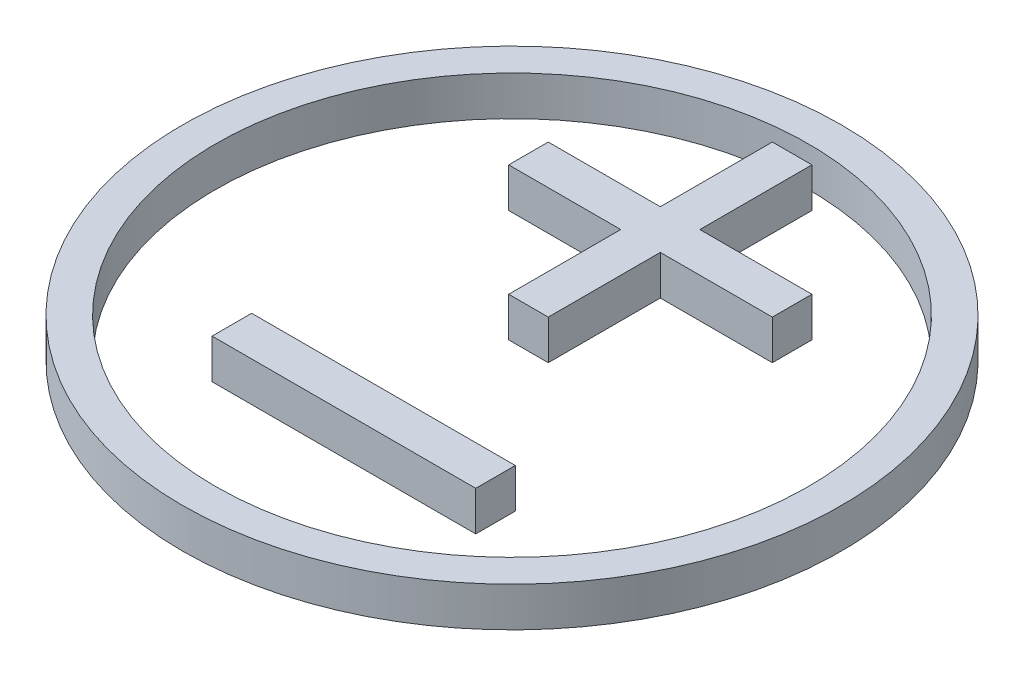
ISO-10303-21;
HEADER;
FILE_DESCRIPTION(('STEP AP214'),'2;1');
FILE_NAME('part.step','',(''),(''),'','','');
FILE_SCHEMA(('AUTOMOTIVE_DESIGN { 1 0 10303 214 1 1 1 1 }'));
ENDSEC;
DATA;
#1=APPLICATION_CONTEXT('core data for automotive mechanical design processes');
#2=APPLICATION_PROTOCOL_DEFINITION('international standard','automotive_design',2000,#1);
#3=PRODUCT_CONTEXT('',#1,'mechanical');
#4=PRODUCT('Part','Part','',(#3));
#5=PRODUCT_RELATED_PRODUCT_CATEGORY('part','',(#4));
#6=PRODUCT_DEFINITION_FORMATION('','',#4);
#7=PRODUCT_DEFINITION_CONTEXT('part definition',#1,'design');
#8=PRODUCT_DEFINITION('design','',#6,#7);
#9=PRODUCT_DEFINITION_SHAPE('','',#8);
#10=(LENGTH_UNIT() NAMED_UNIT(*) SI_UNIT(.MILLI.,.METRE.));
#11=(NAMED_UNIT(*) PLANE_ANGLE_UNIT() SI_UNIT($,.RADIAN.));
#12=(NAMED_UNIT(*) SI_UNIT($,.STERADIAN.) SOLID_ANGLE_UNIT());
#13=UNCERTAINTY_MEASURE_WITH_UNIT(LENGTH_MEASURE(1.E-05),#10,'distance_accuracy_value','');
#14=(GEOMETRIC_REPRESENTATION_CONTEXT(3) GLOBAL_UNCERTAINTY_ASSIGNED_CONTEXT((#13)) GLOBAL_UNIT_ASSIGNED_CONTEXT((#10,
#11,#12)) REPRESENTATION_CONTEXT('',''));
#15=CARTESIAN_POINT('',(0.,0.,0.));
#16=DIRECTION('',(0.,0.,1.));
#17=DIRECTION('',(1.,0.,0.));
#18=AXIS2_PLACEMENT_3D('',#15,#16,#17);
#19=CARTESIAN_POINT('',(0.,6.,0.));
#20=DIRECTION('',(0.,-1.,0.));
#21=DIRECTION('',(0.,0.,-1.));
#22=AXIS2_PLACEMENT_3D('',#19,#20,#21);
#23=CYLINDRICAL_SURFACE('',#22,45.);
#24=CARTESIAN_POINT('',(0.,6.,0.));
#25=DIRECTION('',(0.,1.,0.));
#26=DIRECTION('',(0.,0.,1.));
#27=AXIS2_PLACEMENT_3D('',#24,#25,#26);
#28=CIRCLE('',#27,45.);
#29=CARTESIAN_POINT('',(0.,6.,45.));
#30=VERTEX_POINT('',#29);
#31=EDGE_CURVE('E105',#30,#30,#28,.T.);
#32=ORIENTED_EDGE('',*,*,#31,.T.);
#33=EDGE_LOOP('',(#32));
#34=FACE_BOUND('',#33,.T.);
#35=CARTESIAN_POINT('',(0.,0.,0.));
#36=DIRECTION('',(0.,1.,0.));
#37=DIRECTION('',(0.,0.,1.));
#38=AXIS2_PLACEMENT_3D('',#35,#36,#37);
#39=CIRCLE('',#38,45.);
#40=CARTESIAN_POINT('',(0.,0.,45.));
#41=VERTEX_POINT('',#40);
#42=EDGE_CURVE('E111',#41,#41,#39,.T.);
#43=ORIENTED_EDGE('',*,*,#42,.F.);
#44=EDGE_LOOP('',(#43));
#45=FACE_BOUND('',#44,.T.);
#46=ADVANCED_FACE('F98',(#34,#45),#23,.F.);
#47=CARTESIAN_POINT('',(0.,6.,0.));
#48=DIRECTION('',(0.,-1.,0.));
#49=DIRECTION('',(0.,0.,-1.));
#50=AXIS2_PLACEMENT_3D('',#47,#48,#49);
#51=CYLINDRICAL_SURFACE('',#50,50.);
#52=CARTESIAN_POINT('',(0.,6.,0.));
#53=DIRECTION('',(0.,1.,0.));
#54=DIRECTION('',(0.,0.,1.));
#55=AXIS2_PLACEMENT_3D('',#52,#53,#54);
#56=CIRCLE('',#55,50.);
#57=CARTESIAN_POINT('',(0.,6.,50.));
#58=VERTEX_POINT('',#57);
#59=EDGE_CURVE('E12',#58,#58,#56,.T.);
#60=ORIENTED_EDGE('',*,*,#59,.F.);
#61=EDGE_LOOP('',(#60));
#62=FACE_BOUND('',#61,.T.);
#63=CARTESIAN_POINT('',(0.,0.,0.));
#64=DIRECTION('',(0.,1.,0.));
#65=DIRECTION('',(0.,0.,1.));
#66=AXIS2_PLACEMENT_3D('',#63,#64,#65);
#67=CIRCLE('',#66,50.);
#68=CARTESIAN_POINT('',(0.,0.,50.));
#69=VERTEX_POINT('',#68);
#70=EDGE_CURVE('E101',#69,#69,#67,.T.);
#71=ORIENTED_EDGE('',*,*,#70,.T.);
#72=EDGE_LOOP('',(#71));
#73=FACE_BOUND('',#72,.T.);
#74=ADVANCED_FACE('F118',(#62,#73),#51,.T.);
#75=CARTESIAN_POINT('',(0.,6.,0.));
#76=DIRECTION('',(0.,1.,0.));
#77=DIRECTION('',(0.,0.,1.));
#78=AXIS2_PLACEMENT_3D('',#75,#76,#77);
#79=PLANE('',#78);
#80=ORIENTED_EDGE('',*,*,#31,.F.);
#81=EDGE_LOOP('',(#80));
#82=FACE_BOUND('',#81,.T.);
#83=ORIENTED_EDGE('',*,*,#59,.T.);
#84=EDGE_LOOP('',(#83));
#85=FACE_BOUND('',#84,.T.);
#86=ADVANCED_FACE('F122',(#82,#85),#79,.T.);
#87=CARTESIAN_POINT('',(0.,0.,0.));
#88=DIRECTION('',(0.,1.,0.));
#89=DIRECTION('',(0.,0.,1.));
#90=AXIS2_PLACEMENT_3D('',#87,#88,#89);
#91=PLANE('',#90);
#92=ORIENTED_EDGE('',*,*,#42,.T.);
#93=EDGE_LOOP('',(#92));
#94=FACE_BOUND('',#93,.T.);
#95=ORIENTED_EDGE('',*,*,#70,.F.);
#96=EDGE_LOOP('',(#95));
#97=FACE_BOUND('',#96,.T.);
#98=ADVANCED_FACE('F120',(#94,#97),#91,.F.);
#99=CLOSED_SHELL('',(#46,#74,#86,#98));
#100=MANIFOLD_SOLID_BREP('B2',#99);
#101=CARTESIAN_POINT('',(0.,6.,19.5));
#102=DIRECTION('',(0.,0.,1.));
#103=DIRECTION('',(1.,0.,0.));
#104=AXIS2_PLACEMENT_3D('',#101,#102,#103);
#105=PLANE('',#104);
#106=DIRECTION('',(-1.,0.,0.));
#107=VECTOR('',#106,1.);
#108=CARTESIAN_POINT('',(0.,0.,19.5));
#109=LINE('',#108,#107);
#110=CARTESIAN_POINT('',(20.,0.,19.5));
#111=VERTEX_POINT('',#110);
#112=CARTESIAN_POINT('',(-20.,0.,19.5));
#113=VERTEX_POINT('',#112);
#114=EDGE_CURVE('E231',#111,#113,#109,.T.);
#115=ORIENTED_EDGE('',*,*,#114,.T.);
#116=DIRECTION('',(0.,-1.,0.));
#117=VECTOR('',#116,1.);
#118=CARTESIAN_POINT('',(-20.,6.,19.5));
#119=LINE('',#118,#117);
#120=CARTESIAN_POINT('',(-20.,6.,19.5));
#121=VERTEX_POINT('',#120);
#122=EDGE_CURVE('E96',#121,#113,#119,.T.);
#123=ORIENTED_EDGE('',*,*,#122,.F.);
#124=DIRECTION('',(-1.,0.,0.));
#125=VECTOR('',#124,1.);
#126=CARTESIAN_POINT('',(0.,6.,19.5));
#127=LINE('',#126,#125);
#128=CARTESIAN_POINT('',(20.,6.,19.5));
#129=VERTEX_POINT('',#128);
#130=EDGE_CURVE('E216',#129,#121,#127,.T.);
#131=ORIENTED_EDGE('',*,*,#130,.F.);
#132=DIRECTION('',(0.,-1.,0.));
#133=VECTOR('',#132,1.);
#134=CARTESIAN_POINT('',(20.,6.,19.5));
#135=LINE('',#134,#133);
#136=EDGE_CURVE('E227',#129,#111,#135,.T.);
#137=ORIENTED_EDGE('',*,*,#136,.T.);
#138=EDGE_LOOP('',(#115,#123,#131,#137));
#139=FACE_BOUND('',#138,.T.);
#140=ADVANCED_FACE('F169',(#139),#105,.F.);
#141=CARTESIAN_POINT('',(-20.,6.,0.));
#142=DIRECTION('',(1.,0.,0.));
#143=DIRECTION('',(0.,0.,-1.));
#144=AXIS2_PLACEMENT_3D('',#141,#142,#143);
#145=PLANE('',#144);
#146=DIRECTION('',(0.,0.,1.));
#147=VECTOR('',#146,1.);
#148=CARTESIAN_POINT('',(-20.,0.,0.));
#149=LINE('',#148,#147);
#150=CARTESIAN_POINT('',(-20.,0.,25.5));
#151=VERTEX_POINT('',#150);
#152=EDGE_CURVE('E221',#113,#151,#149,.T.);
#153=ORIENTED_EDGE('',*,*,#152,.T.);
#154=DIRECTION('',(0.,-1.,0.));
#155=VECTOR('',#154,1.);
#156=CARTESIAN_POINT('',(-20.,6.,25.5));
#157=LINE('',#156,#155);
#158=CARTESIAN_POINT('',(-20.,6.,25.5));
#159=VERTEX_POINT('',#158);
#160=EDGE_CURVE('E177',#159,#151,#157,.T.);
#161=ORIENTED_EDGE('',*,*,#160,.F.);
#162=DIRECTION('',(0.,0.,1.));
#163=VECTOR('',#162,1.);
#164=CARTESIAN_POINT('',(-20.,6.,0.));
#165=LINE('',#164,#163);
#166=EDGE_CURVE('E211',#121,#159,#165,.T.);
#167=ORIENTED_EDGE('',*,*,#166,.F.);
#168=ORIENTED_EDGE('',*,*,#122,.T.);
#169=EDGE_LOOP('',(#153,#161,#167,#168));
#170=FACE_BOUND('',#169,.T.);
#171=ADVANCED_FACE('F220',(#170),#145,.F.);
#172=CARTESIAN_POINT('',(0.,6.,25.5));
#173=DIRECTION('',(0.,0.,1.));
#174=DIRECTION('',(1.,0.,0.));
#175=AXIS2_PLACEMENT_3D('',#172,#173,#174);
#176=PLANE('',#175);
#177=DIRECTION('',(-1.,0.,0.));
#178=VECTOR('',#177,1.);
#179=CARTESIAN_POINT('',(0.,0.,25.5));
#180=LINE('',#179,#178);
#181=CARTESIAN_POINT('',(20.,0.,25.5));
#182=VERTEX_POINT('',#181);
#183=EDGE_CURVE('E235',#182,#151,#180,.T.);
#184=ORIENTED_EDGE('',*,*,#183,.F.);
#185=DIRECTION('',(0.,-1.,0.));
#186=VECTOR('',#185,1.);
#187=CARTESIAN_POINT('',(20.,6.,25.5));
#188=LINE('',#187,#186);
#189=CARTESIAN_POINT('',(20.,6.,25.5));
#190=VERTEX_POINT('',#189);
#191=EDGE_CURVE('E201',#190,#182,#188,.T.);
#192=ORIENTED_EDGE('',*,*,#191,.F.);
#193=DIRECTION('',(-1.,0.,0.));
#194=VECTOR('',#193,1.);
#195=CARTESIAN_POINT('',(0.,6.,25.5));
#196=LINE('',#195,#194);
#197=EDGE_CURVE('E214',#190,#159,#196,.T.);
#198=ORIENTED_EDGE('',*,*,#197,.T.);
#199=ORIENTED_EDGE('',*,*,#160,.T.);
#200=EDGE_LOOP('',(#184,#192,#198,#199));
#201=FACE_BOUND('',#200,.T.);
#202=ADVANCED_FACE('F225',(#201),#176,.T.);
#203=CARTESIAN_POINT('',(20.,6.,0.));
#204=DIRECTION('',(-1.,0.,0.));
#205=DIRECTION('',(0.,0.,1.));
#206=AXIS2_PLACEMENT_3D('',#203,#204,#205);
#207=PLANE('',#206);
#208=DIRECTION('',(0.,0.,-1.));
#209=VECTOR('',#208,1.);
#210=CARTESIAN_POINT('',(20.,0.,0.));
#211=LINE('',#210,#209);
#212=EDGE_CURVE('E204',#182,#111,#211,.T.);
#213=ORIENTED_EDGE('',*,*,#212,.T.);
#214=ORIENTED_EDGE('',*,*,#136,.F.);
#215=DIRECTION('',(0.,0.,-1.));
#216=VECTOR('',#215,1.);
#217=CARTESIAN_POINT('',(20.,6.,0.));
#218=LINE('',#217,#216);
#219=EDGE_CURVE('E185',#190,#129,#218,.T.);
#220=ORIENTED_EDGE('',*,*,#219,.F.);
#221=ORIENTED_EDGE('',*,*,#191,.T.);
#222=EDGE_LOOP('',(#213,#214,#220,#221));
#223=FACE_BOUND('',#222,.T.);
#224=ADVANCED_FACE('F248',(#223),#207,.F.);
#225=CARTESIAN_POINT('',(0.,6.,0.));
#226=DIRECTION('',(0.,1.,0.));
#227=DIRECTION('',(0.,0.,1.));
#228=AXIS2_PLACEMENT_3D('',#225,#226,#227);
#229=PLANE('',#228);
#230=ORIENTED_EDGE('',*,*,#130,.T.);
#231=ORIENTED_EDGE('',*,*,#166,.T.);
#232=ORIENTED_EDGE('',*,*,#197,.F.);
#233=ORIENTED_EDGE('',*,*,#219,.T.);
#234=EDGE_LOOP('',(#230,#231,#232,#233));
#235=FACE_BOUND('',#234,.T.);
#236=ADVANCED_FACE('F212',(#235),#229,.T.);
#237=CARTESIAN_POINT('',(0.,0.,0.));
#238=DIRECTION('',(0.,1.,0.));
#239=DIRECTION('',(0.,0.,1.));
#240=AXIS2_PLACEMENT_3D('',#237,#238,#239);
#241=PLANE('',#240);
#242=ORIENTED_EDGE('',*,*,#114,.F.);
#243=ORIENTED_EDGE('',*,*,#212,.F.);
#244=ORIENTED_EDGE('',*,*,#183,.T.);
#245=ORIENTED_EDGE('',*,*,#152,.F.);
#246=EDGE_LOOP('',(#242,#243,#244,#245));
#247=FACE_BOUND('',#246,.T.);
#248=ADVANCED_FACE('F242',(#247),#241,.F.);
#249=CLOSED_SHELL('',(#140,#171,#202,#224,#236,#248));
#250=MANIFOLD_SOLID_BREP('B7',#249);
#251=CARTESIAN_POINT('',(0.,6.,-19.5));
#252=DIRECTION('',(0.,0.,1.));
#253=DIRECTION('',(1.,0.,0.));
#254=AXIS2_PLACEMENT_3D('',#251,#252,#253);
#255=PLANE('',#254);
#256=DIRECTION('',(-1.,0.,0.));
#257=VECTOR('',#256,1.);
#258=CARTESIAN_POINT('',(0.,0.,-19.5));
#259=LINE('',#258,#257);
#260=CARTESIAN_POINT('',(-2.99999999999996,0.,-19.5));
#261=VERTEX_POINT('',#260);
#262=CARTESIAN_POINT('',(-20.,0.,-19.5));
#263=VERTEX_POINT('',#262);
#264=EDGE_CURVE('E424',#261,#263,#259,.T.);
#265=ORIENTED_EDGE('',*,*,#264,.F.);
#266=DIRECTION('',(0.,-1.,0.));
#267=VECTOR('',#266,1.);
#268=CARTESIAN_POINT('',(-2.99999999999996,6.,-19.5));
#269=LINE('',#268,#267);
#270=CARTESIAN_POINT('',(-2.99999999999996,6.,-19.5));
#271=VERTEX_POINT('',#270);
#272=EDGE_CURVE('E167',#271,#261,#269,.T.);
#273=ORIENTED_EDGE('',*,*,#272,.F.);
#274=DIRECTION('',(-1.,0.,0.));
#275=VECTOR('',#274,1.);
#276=CARTESIAN_POINT('',(0.,6.,-19.5));
#277=LINE('',#276,#275);
#278=CARTESIAN_POINT('',(-20.,6.,-19.5));
#279=VERTEX_POINT('',#278);
#280=EDGE_CURVE('E454',#271,#279,#277,.T.);
#281=ORIENTED_EDGE('',*,*,#280,.T.);
#282=DIRECTION('',(0.,-1.,0.));
#283=VECTOR('',#282,1.);
#284=CARTESIAN_POINT('',(-20.,6.,-19.5));
#285=LINE('',#284,#283);
#286=EDGE_CURVE('E321',#279,#263,#285,.T.);
#287=ORIENTED_EDGE('',*,*,#286,.T.);
#288=EDGE_LOOP('',(#265,#273,#281,#287));
#289=FACE_BOUND('',#288,.T.);
#290=ADVANCED_FACE('F305',(#289),#255,.T.);
#291=CARTESIAN_POINT('',(-2.99999999999945,6.,0.));
#292=DIRECTION('',(1.,0.,0.));
#293=DIRECTION('',(0.,0.,-1.));
#294=AXIS2_PLACEMENT_3D('',#291,#292,#293);
#295=PLANE('',#294);
#296=DIRECTION('',(0.,0.,1.));
#297=VECTOR('',#296,1.);
#298=CARTESIAN_POINT('',(-2.99999999999945,0.,0.));
#299=LINE('',#298,#297);
#300=CARTESIAN_POINT('',(-2.99999999999951,0.,-2.49999999999992));
#301=VERTEX_POINT('',#300);
#302=EDGE_CURVE('E426',#261,#301,#299,.T.);
#303=ORIENTED_EDGE('',*,*,#302,.T.);
#304=DIRECTION('',(0.,-1.,0.));
#305=VECTOR('',#304,1.);
#306=CARTESIAN_POINT('',(-2.99999999999951,6.,-2.49999999999992));
#307=LINE('',#306,#305);
#308=CARTESIAN_POINT('',(-2.99999999999951,6.,-2.49999999999992));
#309=VERTEX_POINT('',#308);
#310=EDGE_CURVE('E313',#309,#301,#307,.T.);
#311=ORIENTED_EDGE('',*,*,#310,.F.);
#312=DIRECTION('',(0.,0.,1.));
#313=VECTOR('',#312,1.);
#314=CARTESIAN_POINT('',(-2.99999999999945,6.,0.));
#315=LINE('',#314,#313);
#316=EDGE_CURVE('E494',#271,#309,#315,.T.);
#317=ORIENTED_EDGE('',*,*,#316,.F.);
#318=ORIENTED_EDGE('',*,*,#272,.T.);
#319=EDGE_LOOP('',(#303,#311,#317,#318));
#320=FACE_BOUND('',#319,.T.);
#321=ADVANCED_FACE('F523',(#320),#295,.F.);
#322=CARTESIAN_POINT('',(0.,6.,-2.5));
#323=DIRECTION('',(0.,0.,-1.));
#324=DIRECTION('',(-1.,0.,0.));
#325=AXIS2_PLACEMENT_3D('',#322,#323,#324);
#326=PLANE('',#325);
#327=DIRECTION('',(1.,0.,0.));
#328=VECTOR('',#327,1.);
#329=CARTESIAN_POINT('',(0.,0.,-2.5));
#330=LINE('',#329,#328);
#331=CARTESIAN_POINT('',(3.00000000000048,0.,-2.50000000000007));
#332=VERTEX_POINT('',#331);
#333=EDGE_CURVE('E428',#301,#332,#330,.T.);
#334=ORIENTED_EDGE('',*,*,#333,.T.);
#335=DIRECTION('',(0.,-1.,0.));
#336=VECTOR('',#335,1.);
#337=CARTESIAN_POINT('',(3.00000000000048,6.,-2.50000000000007));
#338=LINE('',#337,#336);
#339=CARTESIAN_POINT('',(3.00000000000048,6.,-2.50000000000007));
#340=VERTEX_POINT('',#339);
#341=EDGE_CURVE('E469',#340,#332,#338,.T.);
#342=ORIENTED_EDGE('',*,*,#341,.F.);
#343=DIRECTION('',(1.,0.,0.));
#344=VECTOR('',#343,1.);
#345=CARTESIAN_POINT('',(0.,6.,-2.5));
#346=LINE('',#345,#344);
#347=EDGE_CURVE('E477',#309,#340,#346,.T.);
#348=ORIENTED_EDGE('',*,*,#347,.F.);
#349=ORIENTED_EDGE('',*,*,#310,.T.);
#350=EDGE_LOOP('',(#334,#342,#348,#349));
#351=FACE_BOUND('',#350,.T.);
#352=ADVANCED_FACE('F475',(#351),#326,.F.);
#353=CARTESIAN_POINT('',(3.00000000000054,6.,0.));
#354=DIRECTION('',(1.,0.,0.));
#355=DIRECTION('',(0.,0.,-1.));
#356=AXIS2_PLACEMENT_3D('',#353,#354,#355);
#357=PLANE('',#356);
#358=DIRECTION('',(0.,0.,1.));
#359=VECTOR('',#358,1.);
#360=CARTESIAN_POINT('',(3.00000000000054,0.,0.));
#361=LINE('',#360,#359);
#362=CARTESIAN_POINT('',(3.00000000000024,0.,-19.5));
#363=VERTEX_POINT('',#362);
#364=EDGE_CURVE('E431',#363,#332,#361,.T.);
#365=ORIENTED_EDGE('',*,*,#364,.F.);
#366=DIRECTION('',(0.,-1.,0.));
#367=VECTOR('',#366,1.);
#368=CARTESIAN_POINT('',(3.00000000000024,6.,-19.5));
#369=LINE('',#368,#367);
#370=CARTESIAN_POINT('',(3.00000000000024,6.,-19.5));
#371=VERTEX_POINT('',#370);
#372=EDGE_CURVE('E467',#371,#363,#369,.T.);
#373=ORIENTED_EDGE('',*,*,#372,.F.);
#374=DIRECTION('',(0.,0.,1.));
#375=VECTOR('',#374,1.);
#376=CARTESIAN_POINT('',(3.00000000000054,6.,0.));
#377=LINE('',#376,#375);
#378=EDGE_CURVE('E489',#371,#340,#377,.T.);
#379=ORIENTED_EDGE('',*,*,#378,.T.);
#380=ORIENTED_EDGE('',*,*,#341,.T.);
#381=EDGE_LOOP('',(#365,#373,#379,#380));
#382=FACE_BOUND('',#381,.T.);
#383=ADVANCED_FACE('F485',(#382),#357,.T.);
#384=CARTESIAN_POINT('',(0.,6.,-19.5));
#385=DIRECTION('',(0.,0.,-1.));
#386=DIRECTION('',(-1.,0.,0.));
#387=AXIS2_PLACEMENT_3D('',#384,#385,#386);
#388=PLANE('',#387);
#389=DIRECTION('',(1.,0.,0.));
#390=VECTOR('',#389,1.);
#391=CARTESIAN_POINT('',(0.,0.,-19.5));
#392=LINE('',#391,#390);
#393=CARTESIAN_POINT('',(20.,0.,-19.5));
#394=VERTEX_POINT('',#393);
#395=EDGE_CURVE('E434',#363,#394,#392,.T.);
#396=ORIENTED_EDGE('',*,*,#395,.T.);
#397=DIRECTION('',(0.,-1.,0.));
#398=VECTOR('',#397,1.);
#399=CARTESIAN_POINT('',(20.,6.,-19.5));
#400=LINE('',#399,#398);
#401=CARTESIAN_POINT('',(20.,6.,-19.5));
#402=VERTEX_POINT('',#401);
#403=EDGE_CURVE('E465',#402,#394,#400,.T.);
#404=ORIENTED_EDGE('',*,*,#403,.F.);
#405=DIRECTION('',(1.,0.,0.));
#406=VECTOR('',#405,1.);
#407=CARTESIAN_POINT('',(0.,6.,-19.5));
#408=LINE('',#407,#406);
#409=EDGE_CURVE('E490',#371,#402,#408,.T.);
#410=ORIENTED_EDGE('',*,*,#409,.F.);
#411=ORIENTED_EDGE('',*,*,#372,.T.);
#412=EDGE_LOOP('',(#396,#404,#410,#411));
#413=FACE_BOUND('',#412,.T.);
#414=ADVANCED_FACE('F534',(#413),#388,.F.);
#415=CARTESIAN_POINT('',(20.,6.,0.));
#416=DIRECTION('',(1.,0.,0.));
#417=DIRECTION('',(0.,0.,-1.));
#418=AXIS2_PLACEMENT_3D('',#415,#416,#417);
#419=PLANE('',#418);
#420=DIRECTION('',(0.,0.,1.));
#421=VECTOR('',#420,1.);
#422=CARTESIAN_POINT('',(20.,0.,0.));
#423=LINE('',#422,#421);
#424=CARTESIAN_POINT('',(20.,0.,-25.5));
#425=VERTEX_POINT('',#424);
#426=EDGE_CURVE('E437',#425,#394,#423,.T.);
#427=ORIENTED_EDGE('',*,*,#426,.F.);
#428=DIRECTION('',(0.,-1.,0.));
#429=VECTOR('',#428,1.);
#430=CARTESIAN_POINT('',(20.,6.,-25.5));
#431=LINE('',#430,#429);
#432=CARTESIAN_POINT('',(20.,6.,-25.5));
#433=VERTEX_POINT('',#432);
#434=EDGE_CURVE('E463',#433,#425,#431,.T.);
#435=ORIENTED_EDGE('',*,*,#434,.F.);
#436=DIRECTION('',(0.,0.,1.));
#437=VECTOR('',#436,1.);
#438=CARTESIAN_POINT('',(20.,6.,0.));
#439=LINE('',#438,#437);
#440=EDGE_CURVE('E492',#433,#402,#439,.T.);
#441=ORIENTED_EDGE('',*,*,#440,.T.);
#442=ORIENTED_EDGE('',*,*,#403,.T.);
#443=EDGE_LOOP('',(#427,#435,#441,#442));
#444=FACE_BOUND('',#443,.T.);
#445=ADVANCED_FACE('F537',(#444),#419,.T.);
#446=CARTESIAN_POINT('',(0.,6.,-25.5));
#447=DIRECTION('',(0.,0.,-1.));
#448=DIRECTION('',(-1.,0.,0.));
#449=AXIS2_PLACEMENT_3D('',#446,#447,#448);
#450=PLANE('',#449);
#451=DIRECTION('',(1.,0.,0.));
#452=VECTOR('',#451,1.);
#453=CARTESIAN_POINT('',(0.,0.,-25.5));
#454=LINE('',#453,#452);
#455=CARTESIAN_POINT('',(2.99999999999996,0.,-25.5));
#456=VERTEX_POINT('',#455);
#457=EDGE_CURVE('E440',#456,#425,#454,.T.);
#458=ORIENTED_EDGE('',*,*,#457,.F.);
#459=DIRECTION('',(0.,-1.,0.));
#460=VECTOR('',#459,1.);
#461=CARTESIAN_POINT('',(2.99999999999996,6.,-25.5));
#462=LINE('',#461,#460);
#463=CARTESIAN_POINT('',(2.99999999999996,6.,-25.5));
#464=VERTEX_POINT('',#463);
#465=EDGE_CURVE('E461',#464,#456,#462,.T.);
#466=ORIENTED_EDGE('',*,*,#465,.F.);
#467=DIRECTION('',(1.,0.,0.));
#468=VECTOR('',#467,1.);
#469=CARTESIAN_POINT('',(0.,6.,-25.5));
#470=LINE('',#469,#468);
#471=EDGE_CURVE('E500',#464,#433,#470,.T.);
#472=ORIENTED_EDGE('',*,*,#471,.T.);
#473=ORIENTED_EDGE('',*,*,#434,.T.);
#474=EDGE_LOOP('',(#458,#466,#472,#473));
#475=FACE_BOUND('',#474,.T.);
#476=ADVANCED_FACE('F541',(#475),#450,.T.);
#477=CARTESIAN_POINT('',(3.00000000000054,6.,0.));
#478=DIRECTION('',(-1.,0.,0.));
#479=DIRECTION('',(0.,0.,1.));
#480=AXIS2_PLACEMENT_3D('',#477,#478,#479);
#481=PLANE('',#480);
#482=DIRECTION('',(0.,0.,-1.));
#483=VECTOR('',#482,1.);
#484=CARTESIAN_POINT('',(3.00000000000054,0.,0.));
#485=LINE('',#484,#483);
#486=CARTESIAN_POINT('',(2.99999999999951,0.,-42.5000000000001));
#487=VERTEX_POINT('',#486);
#488=EDGE_CURVE('E443',#456,#487,#485,.T.);
#489=ORIENTED_EDGE('',*,*,#488,.T.);
#490=DIRECTION('',(0.,-1.,0.));
#491=VECTOR('',#490,1.);
#492=CARTESIAN_POINT('',(2.99999999999951,6.,-42.5000000000001));
#493=LINE('',#492,#491);
#494=CARTESIAN_POINT('',(2.99999999999951,6.,-42.5000000000001));
#495=VERTEX_POINT('',#494);
#496=EDGE_CURVE('E458',#495,#487,#493,.T.);
#497=ORIENTED_EDGE('',*,*,#496,.F.);
#498=DIRECTION('',(0.,0.,-1.));
#499=VECTOR('',#498,1.);
#500=CARTESIAN_POINT('',(3.00000000000054,6.,0.));
#501=LINE('',#500,#499);
#502=EDGE_CURVE('E419',#464,#495,#501,.T.);
#503=ORIENTED_EDGE('',*,*,#502,.F.);
#504=ORIENTED_EDGE('',*,*,#465,.T.);
#505=EDGE_LOOP('',(#489,#497,#503,#504));
#506=FACE_BOUND('',#505,.T.);
#507=ADVANCED_FACE('F507',(#506),#481,.F.);
#508=CARTESIAN_POINT('',(-1.0321604682062E-12,6.,-42.5));
#509=DIRECTION('',(0.,0.,1.));
#510=DIRECTION('',(1.,0.,0.));
#511=AXIS2_PLACEMENT_3D('',#508,#509,#510);
#512=PLANE('',#511);
#513=DIRECTION('',(-1.,0.,0.));
#514=VECTOR('',#513,1.);
#515=CARTESIAN_POINT('',(-1.0321604682062E-12,0.,-42.5));
#516=LINE('',#515,#514);
#517=CARTESIAN_POINT('',(-3.00000000000048,0.,-42.4999999999999));
#518=VERTEX_POINT('',#517);
#519=EDGE_CURVE('E445',#487,#518,#516,.T.);
#520=ORIENTED_EDGE('',*,*,#519,.T.);
#521=DIRECTION('',(0.,-1.,0.));
#522=VECTOR('',#521,1.);
#523=CARTESIAN_POINT('',(-3.00000000000048,6.,-42.4999999999999));
#524=LINE('',#523,#522);
#525=CARTESIAN_POINT('',(-3.00000000000048,6.,-42.4999999999999));
#526=VERTEX_POINT('',#525);
#527=EDGE_CURVE('E405',#526,#518,#524,.T.);
#528=ORIENTED_EDGE('',*,*,#527,.F.);
#529=DIRECTION('',(-1.,0.,0.));
#530=VECTOR('',#529,1.);
#531=CARTESIAN_POINT('',(-1.0321604682062E-12,6.,-42.5));
#532=LINE('',#531,#530);
#533=EDGE_CURVE('E416',#495,#526,#532,.T.);
#534=ORIENTED_EDGE('',*,*,#533,.F.);
#535=ORIENTED_EDGE('',*,*,#496,.T.);
#536=EDGE_LOOP('',(#520,#528,#534,#535));
#537=FACE_BOUND('',#536,.T.);
#538=ADVANCED_FACE('F511',(#537),#512,.F.);
#539=CARTESIAN_POINT('',(-2.99999999999946,6.,0.));
#540=DIRECTION('',(-1.,0.,0.));
#541=DIRECTION('',(0.,0.,1.));
#542=AXIS2_PLACEMENT_3D('',#539,#540,#541);
#543=PLANE('',#542);
#544=DIRECTION('',(0.,0.,-1.));
#545=VECTOR('',#544,1.);
#546=CARTESIAN_POINT('',(-2.99999999999946,0.,0.));
#547=LINE('',#546,#545);
#548=CARTESIAN_POINT('',(-3.00000000000024,0.,-25.5));
#549=VERTEX_POINT('',#548);
#550=EDGE_CURVE('E402',#549,#518,#547,.T.);
#551=ORIENTED_EDGE('',*,*,#550,.F.);
#552=DIRECTION('',(0.,-1.,0.));
#553=VECTOR('',#552,1.);
#554=CARTESIAN_POINT('',(-3.00000000000024,6.,-25.5));
#555=LINE('',#554,#553);
#556=CARTESIAN_POINT('',(-3.00000000000024,6.,-25.5));
#557=VERTEX_POINT('',#556);
#558=EDGE_CURVE('E396',#557,#549,#555,.T.);
#559=ORIENTED_EDGE('',*,*,#558,.F.);
#560=DIRECTION('',(0.,0.,-1.));
#561=VECTOR('',#560,1.);
#562=CARTESIAN_POINT('',(-2.99999999999946,6.,0.));
#563=LINE('',#562,#561);
#564=EDGE_CURVE('E400',#557,#526,#563,.T.);
#565=ORIENTED_EDGE('',*,*,#564,.T.);
#566=ORIENTED_EDGE('',*,*,#527,.T.);
#567=EDGE_LOOP('',(#551,#559,#565,#566));
#568=FACE_BOUND('',#567,.T.);
#569=ADVANCED_FACE('F398',(#568),#543,.T.);
#570=CARTESIAN_POINT('',(0.,6.,-25.5));
#571=DIRECTION('',(0.,0.,1.));
#572=DIRECTION('',(1.,0.,0.));
#573=AXIS2_PLACEMENT_3D('',#570,#571,#572);
#574=PLANE('',#573);
#575=DIRECTION('',(-1.,0.,0.));
#576=VECTOR('',#575,1.);
#577=CARTESIAN_POINT('',(0.,0.,-25.5));
#578=LINE('',#577,#576);
#579=CARTESIAN_POINT('',(-20.,0.,-25.5));
#580=VERTEX_POINT('',#579);
#581=EDGE_CURVE('E449',#549,#580,#578,.T.);
#582=ORIENTED_EDGE('',*,*,#581,.T.);
#583=DIRECTION('',(0.,-1.,0.));
#584=VECTOR('',#583,1.);
#585=CARTESIAN_POINT('',(-20.,6.,-25.5));
#586=LINE('',#585,#584);
#587=CARTESIAN_POINT('',(-20.,6.,-25.5));
#588=VERTEX_POINT('',#587);
#589=EDGE_CURVE('E359',#588,#580,#586,.T.);
#590=ORIENTED_EDGE('',*,*,#589,.F.);
#591=DIRECTION('',(-1.,0.,0.));
#592=VECTOR('',#591,1.);
#593=CARTESIAN_POINT('',(0.,6.,-25.5));
#594=LINE('',#593,#592);
#595=EDGE_CURVE('E407',#557,#588,#594,.T.);
#596=ORIENTED_EDGE('',*,*,#595,.F.);
#597=ORIENTED_EDGE('',*,*,#558,.T.);
#598=EDGE_LOOP('',(#582,#590,#596,#597));
#599=FACE_BOUND('',#598,.T.);
#600=ADVANCED_FACE('F408',(#599),#574,.F.);
#601=CARTESIAN_POINT('',(-20.,6.,0.));
#602=DIRECTION('',(-1.,0.,0.));
#603=DIRECTION('',(0.,0.,1.));
#604=AXIS2_PLACEMENT_3D('',#601,#602,#603);
#605=PLANE('',#604);
#606=DIRECTION('',(0.,0.,-1.));
#607=VECTOR('',#606,1.);
#608=CARTESIAN_POINT('',(-20.,0.,0.));
#609=LINE('',#608,#607);
#610=EDGE_CURVE('E451',#263,#580,#609,.T.);
#611=ORIENTED_EDGE('',*,*,#610,.F.);
#612=ORIENTED_EDGE('',*,*,#286,.F.);
#613=DIRECTION('',(0.,0.,-1.));
#614=VECTOR('',#613,1.);
#615=CARTESIAN_POINT('',(-20.,6.,0.));
#616=LINE('',#615,#614);
#617=EDGE_CURVE('E411',#279,#588,#616,.T.);
#618=ORIENTED_EDGE('',*,*,#617,.T.);
#619=ORIENTED_EDGE('',*,*,#589,.T.);
#620=EDGE_LOOP('',(#611,#612,#618,#619));
#621=FACE_BOUND('',#620,.T.);
#622=ADVANCED_FACE('F512',(#621),#605,.T.);
#623=CARTESIAN_POINT('',(0.,6.,0.));
#624=DIRECTION('',(0.,1.,0.));
#625=DIRECTION('',(0.,0.,1.));
#626=AXIS2_PLACEMENT_3D('',#623,#624,#625);
#627=PLANE('',#626);
#628=ORIENTED_EDGE('',*,*,#280,.F.);
#629=ORIENTED_EDGE('',*,*,#316,.T.);
#630=ORIENTED_EDGE('',*,*,#347,.T.);
#631=ORIENTED_EDGE('',*,*,#378,.F.);
#632=ORIENTED_EDGE('',*,*,#409,.T.);
#633=ORIENTED_EDGE('',*,*,#440,.F.);
#634=ORIENTED_EDGE('',*,*,#471,.F.);
#635=ORIENTED_EDGE('',*,*,#502,.T.);
#636=ORIENTED_EDGE('',*,*,#533,.T.);
#637=ORIENTED_EDGE('',*,*,#564,.F.);
#638=ORIENTED_EDGE('',*,*,#595,.T.);
#639=ORIENTED_EDGE('',*,*,#617,.F.);
#640=EDGE_LOOP('',(#628,#629,#630,#631,#632,#633,#634,#635,#636,#637,#638,#639));
#641=FACE_BOUND('',#640,.T.);
#642=ADVANCED_FACE('F414',(#641),#627,.T.);
#643=CARTESIAN_POINT('',(0.,0.,0.));
#644=DIRECTION('',(0.,1.,0.));
#645=DIRECTION('',(0.,0.,1.));
#646=AXIS2_PLACEMENT_3D('',#643,#644,#645);
#647=PLANE('',#646);
#648=ORIENTED_EDGE('',*,*,#264,.T.);
#649=ORIENTED_EDGE('',*,*,#610,.T.);
#650=ORIENTED_EDGE('',*,*,#581,.F.);
#651=ORIENTED_EDGE('',*,*,#550,.T.);
#652=ORIENTED_EDGE('',*,*,#519,.F.);
#653=ORIENTED_EDGE('',*,*,#488,.F.);
#654=ORIENTED_EDGE('',*,*,#457,.T.);
#655=ORIENTED_EDGE('',*,*,#426,.T.);
#656=ORIENTED_EDGE('',*,*,#395,.F.);
#657=ORIENTED_EDGE('',*,*,#364,.T.);
#658=ORIENTED_EDGE('',*,*,#333,.F.);
#659=ORIENTED_EDGE('',*,*,#302,.F.);
#660=EDGE_LOOP('',(#648,#649,#650,#651,#652,#653,#654,#655,#656,#657,#658,#659));
#661=FACE_BOUND('',#660,.T.);
#662=ADVANCED_FACE('F481',(#661),#647,.F.);
#663=CLOSED_SHELL('',(#290,#321,#352,#383,#414,#445,#476,#507,#538,#569,#600,#622,#642,#662));
#664=MANIFOLD_SOLID_BREP('B90',#663);
#665=ADVANCED_BREP_SHAPE_REPRESENTATION('',(#18,#100,#250,#664),#14);
#666=SHAPE_DEFINITION_REPRESENTATION(#9,#665);
ENDSEC;
END-ISO-10303-21;
